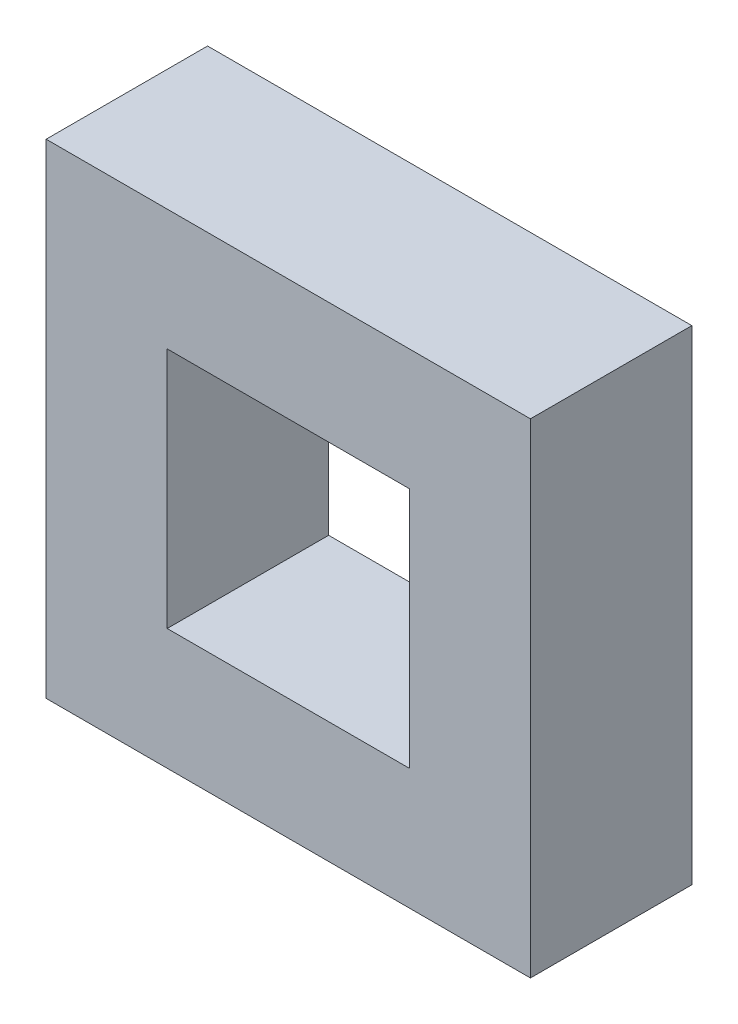
ISO-10303-21;
HEADER;
FILE_DESCRIPTION(('STEP AP214'),'2;1');
FILE_NAME('part.step','',(''),(''),'','','');
FILE_SCHEMA(('AUTOMOTIVE_DESIGN { 1 0 10303 214 1 1 1 1 }'));
ENDSEC;
DATA;
#1=APPLICATION_CONTEXT('core data for automotive mechanical design processes');
#2=APPLICATION_PROTOCOL_DEFINITION('international standard','automotive_design',2000,#1);
#3=PRODUCT_CONTEXT('',#1,'mechanical');
#4=PRODUCT('Part','Part','',(#3));
#5=PRODUCT_RELATED_PRODUCT_CATEGORY('part','',(#4));
#6=PRODUCT_DEFINITION_FORMATION('','',#4);
#7=PRODUCT_DEFINITION_CONTEXT('part definition',#1,'design');
#8=PRODUCT_DEFINITION('design','',#6,#7);
#9=PRODUCT_DEFINITION_SHAPE('','',#8);
#10=(LENGTH_UNIT() NAMED_UNIT(*) SI_UNIT(.MILLI.,.METRE.));
#11=(NAMED_UNIT(*) PLANE_ANGLE_UNIT() SI_UNIT($,.RADIAN.));
#12=(NAMED_UNIT(*) SI_UNIT($,.STERADIAN.) SOLID_ANGLE_UNIT());
#13=UNCERTAINTY_MEASURE_WITH_UNIT(LENGTH_MEASURE(1.E-05),#10,'distance_accuracy_value','');
#14=(GEOMETRIC_REPRESENTATION_CONTEXT(3) GLOBAL_UNCERTAINTY_ASSIGNED_CONTEXT((#13)) GLOBAL_UNIT_ASSIGNED_CONTEXT((#10,
#11,#12)) REPRESENTATION_CONTEXT('',''));
#15=CARTESIAN_POINT('',(0.,0.,0.));
#16=DIRECTION('',(0.,0.,1.));
#17=DIRECTION('',(1.,0.,0.));
#18=AXIS2_PLACEMENT_3D('',#15,#16,#17);
#19=CARTESIAN_POINT('',(-38.1,38.1,12.7));
#20=DIRECTION('',(1.,0.,0.));
#21=DIRECTION('',(0.,1.,0.));
#22=AXIS2_PLACEMENT_3D('',#19,#20,#21);
#23=PLANE('',#22);
#24=DIRECTION('',(0.,-1.,0.));
#25=VECTOR('',#24,1.);
#26=CARTESIAN_POINT('',(-38.1,38.1,-12.7));
#27=LINE('',#26,#25);
#28=CARTESIAN_POINT('',(-38.1,38.1,-12.7));
#29=VERTEX_POINT('',#28);
#30=CARTESIAN_POINT('',(-38.1,-38.1,-12.7));
#31=VERTEX_POINT('',#30);
#32=EDGE_CURVE('E130',#29,#31,#27,.T.);
#33=ORIENTED_EDGE('',*,*,#32,.T.);
#34=DIRECTION('',(0.,0.,-1.));
#35=VECTOR('',#34,1.);
#36=CARTESIAN_POINT('',(-38.1,-38.1,12.7));
#37=LINE('',#36,#35);
#38=CARTESIAN_POINT('',(-38.1,-38.1,12.7));
#39=VERTEX_POINT('',#38);
#40=EDGE_CURVE('E11',#39,#31,#37,.T.);
#41=ORIENTED_EDGE('',*,*,#40,.F.);
#42=DIRECTION('',(0.,-1.,0.));
#43=VECTOR('',#42,1.);
#44=CARTESIAN_POINT('',(-38.1,38.1,12.7));
#45=LINE('',#44,#43);
#46=CARTESIAN_POINT('',(-38.1,38.1,12.7));
#47=VERTEX_POINT('',#46);
#48=EDGE_CURVE('E134',#47,#39,#45,.T.);
#49=ORIENTED_EDGE('',*,*,#48,.F.);
#50=DIRECTION('',(0.,0.,-1.));
#51=VECTOR('',#50,1.);
#52=CARTESIAN_POINT('',(-38.1,38.1,12.7));
#53=LINE('',#52,#51);
#54=EDGE_CURVE('E144',#47,#29,#53,.T.);
#55=ORIENTED_EDGE('',*,*,#54,.T.);
#56=EDGE_LOOP('',(#33,#41,#49,#55));
#57=FACE_BOUND('',#56,.T.);
#58=ADVANCED_FACE('F33',(#57),#23,.F.);
#59=CARTESIAN_POINT('',(-38.1,-38.1,12.7));
#60=DIRECTION('',(0.,1.,0.));
#61=DIRECTION('',(0.,0.,1.));
#62=AXIS2_PLACEMENT_3D('',#59,#60,#61);
#63=PLANE('',#62);
#64=DIRECTION('',(1.,0.,0.));
#65=VECTOR('',#64,1.);
#66=CARTESIAN_POINT('',(-38.1,-38.1,-12.7));
#67=LINE('',#66,#65);
#68=CARTESIAN_POINT('',(38.1,-38.1,-12.7));
#69=VERTEX_POINT('',#68);
#70=EDGE_CURVE('E147',#31,#69,#67,.T.);
#71=ORIENTED_EDGE('',*,*,#70,.T.);
#72=DIRECTION('',(0.,0.,-1.));
#73=VECTOR('',#72,1.);
#74=CARTESIAN_POINT('',(38.1,-38.1,12.7));
#75=LINE('',#74,#73);
#76=CARTESIAN_POINT('',(38.1,-38.1,12.7));
#77=VERTEX_POINT('',#76);
#78=EDGE_CURVE('E40',#77,#69,#75,.T.);
#79=ORIENTED_EDGE('',*,*,#78,.F.);
#80=DIRECTION('',(1.,0.,0.));
#81=VECTOR('',#80,1.);
#82=CARTESIAN_POINT('',(-38.1,-38.1,12.7));
#83=LINE('',#82,#81);
#84=EDGE_CURVE('E137',#39,#77,#83,.T.);
#85=ORIENTED_EDGE('',*,*,#84,.F.);
#86=ORIENTED_EDGE('',*,*,#40,.T.);
#87=EDGE_LOOP('',(#71,#79,#85,#86));
#88=FACE_BOUND('',#87,.T.);
#89=ADVANCED_FACE('F175',(#88),#63,.F.);
#90=CARTESIAN_POINT('',(38.1,38.1,12.7));
#91=DIRECTION('',(-1.,0.,0.));
#92=DIRECTION('',(0.,-1.,0.));
#93=AXIS2_PLACEMENT_3D('',#90,#91,#92);
#94=PLANE('',#93);
#95=DIRECTION('',(0.,1.,0.));
#96=VECTOR('',#95,1.);
#97=CARTESIAN_POINT('',(38.1,38.1,-12.7));
#98=LINE('',#97,#96);
#99=CARTESIAN_POINT('',(38.1,38.1,-12.7));
#100=VERTEX_POINT('',#99);
#101=EDGE_CURVE('E149',#69,#100,#98,.T.);
#102=ORIENTED_EDGE('',*,*,#101,.T.);
#103=DIRECTION('',(0.,0.,-1.));
#104=VECTOR('',#103,1.);
#105=CARTESIAN_POINT('',(38.1,38.1,12.7));
#106=LINE('',#105,#104);
#107=CARTESIAN_POINT('',(38.1,38.1,12.7));
#108=VERTEX_POINT('',#107);
#109=EDGE_CURVE('E154',#108,#100,#106,.T.);
#110=ORIENTED_EDGE('',*,*,#109,.F.);
#111=DIRECTION('',(0.,1.,0.));
#112=VECTOR('',#111,1.);
#113=CARTESIAN_POINT('',(38.1,38.1,12.7));
#114=LINE('',#113,#112);
#115=EDGE_CURVE('E140',#77,#108,#114,.T.);
#116=ORIENTED_EDGE('',*,*,#115,.F.);
#117=ORIENTED_EDGE('',*,*,#78,.T.);
#118=EDGE_LOOP('',(#102,#110,#116,#117));
#119=FACE_BOUND('',#118,.T.);
#120=ADVANCED_FACE('F161',(#119),#94,.F.);
#121=CARTESIAN_POINT('',(-38.1,38.1,12.7));
#122=DIRECTION('',(0.,-1.,0.));
#123=DIRECTION('',(0.,0.,-1.));
#124=AXIS2_PLACEMENT_3D('',#121,#122,#123);
#125=PLANE('',#124);
#126=DIRECTION('',(-1.,0.,0.));
#127=VECTOR('',#126,1.);
#128=CARTESIAN_POINT('',(-38.1,38.1,-12.7));
#129=LINE('',#128,#127);
#130=EDGE_CURVE('E138',#100,#29,#129,.T.);
#131=ORIENTED_EDGE('',*,*,#130,.T.);
#132=ORIENTED_EDGE('',*,*,#54,.F.);
#133=DIRECTION('',(-1.,0.,0.));
#134=VECTOR('',#133,1.);
#135=CARTESIAN_POINT('',(-38.1,38.1,12.7));
#136=LINE('',#135,#134);
#137=EDGE_CURVE('E142',#108,#47,#136,.T.);
#138=ORIENTED_EDGE('',*,*,#137,.F.);
#139=ORIENTED_EDGE('',*,*,#109,.T.);
#140=EDGE_LOOP('',(#131,#132,#138,#139));
#141=FACE_BOUND('',#140,.T.);
#142=ADVANCED_FACE('F168',(#141),#125,.F.);
#143=CARTESIAN_POINT('',(0.,0.,12.7));
#144=DIRECTION('',(0.,0.,1.));
#145=DIRECTION('',(1.,0.,0.));
#146=AXIS2_PLACEMENT_3D('',#143,#144,#145);
#147=PLANE('',#146);
#148=DIRECTION('',(0.,-1.,0.));
#149=VECTOR('',#148,1.);
#150=CARTESIAN_POINT('',(-19.05,19.05,12.7));
#151=LINE('',#150,#149);
#152=CARTESIAN_POINT('',(-19.05,19.05,12.7));
#153=VERTEX_POINT('',#152);
#154=CARTESIAN_POINT('',(-19.05,-19.05,12.7));
#155=VERTEX_POINT('',#154);
#156=EDGE_CURVE('E47',#153,#155,#151,.T.);
#157=ORIENTED_EDGE('',*,*,#156,.F.);
#158=DIRECTION('',(-1.,0.,0.));
#159=VECTOR('',#158,1.);
#160=CARTESIAN_POINT('',(-19.05,19.05,12.7));
#161=LINE('',#160,#159);
#162=CARTESIAN_POINT('',(19.05,19.05,12.7));
#163=VERTEX_POINT('',#162);
#164=EDGE_CURVE('E115',#163,#153,#161,.T.);
#165=ORIENTED_EDGE('',*,*,#164,.F.);
#166=DIRECTION('',(0.,1.,0.));
#167=VECTOR('',#166,1.);
#168=CARTESIAN_POINT('',(19.05,19.05,12.7));
#169=LINE('',#168,#167);
#170=CARTESIAN_POINT('',(19.05,-19.05,12.7));
#171=VERTEX_POINT('',#170);
#172=EDGE_CURVE('E118',#171,#163,#169,.T.);
#173=ORIENTED_EDGE('',*,*,#172,.F.);
#174=DIRECTION('',(1.,0.,0.));
#175=VECTOR('',#174,1.);
#176=CARTESIAN_POINT('',(-19.05,-19.05,12.7));
#177=LINE('',#176,#175);
#178=EDGE_CURVE('E124',#155,#171,#177,.T.);
#179=ORIENTED_EDGE('',*,*,#178,.F.);
#180=EDGE_LOOP('',(#157,#165,#173,#179));
#181=FACE_BOUND('',#180,.T.);
#182=ORIENTED_EDGE('',*,*,#48,.T.);
#183=ORIENTED_EDGE('',*,*,#84,.T.);
#184=ORIENTED_EDGE('',*,*,#115,.T.);
#185=ORIENTED_EDGE('',*,*,#137,.T.);
#186=EDGE_LOOP('',(#182,#183,#184,#185));
#187=FACE_BOUND('',#186,.T.);
#188=ADVANCED_FACE('F174',(#181,#187),#147,.T.);
#189=CARTESIAN_POINT('',(0.,0.,-12.7));
#190=DIRECTION('',(0.,0.,1.));
#191=DIRECTION('',(1.,0.,0.));
#192=AXIS2_PLACEMENT_3D('',#189,#190,#191);
#193=PLANE('',#192);
#194=DIRECTION('',(-1.,0.,0.));
#195=VECTOR('',#194,1.);
#196=CARTESIAN_POINT('',(-19.05,19.05,-12.7));
#197=LINE('',#196,#195);
#198=CARTESIAN_POINT('',(19.05,19.05,-12.7));
#199=VERTEX_POINT('',#198);
#200=CARTESIAN_POINT('',(-19.05,19.05,-12.7));
#201=VERTEX_POINT('',#200);
#202=EDGE_CURVE('E105',#199,#201,#197,.T.);
#203=ORIENTED_EDGE('',*,*,#202,.T.);
#204=DIRECTION('',(0.,-1.,0.));
#205=VECTOR('',#204,1.);
#206=CARTESIAN_POINT('',(-19.05,19.05,-12.7));
#207=LINE('',#206,#205);
#208=CARTESIAN_POINT('',(-19.05,-19.05,-12.7));
#209=VERTEX_POINT('',#208);
#210=EDGE_CURVE('E99',#201,#209,#207,.T.);
#211=ORIENTED_EDGE('',*,*,#210,.T.);
#212=DIRECTION('',(1.,0.,0.));
#213=VECTOR('',#212,1.);
#214=CARTESIAN_POINT('',(-19.05,-19.05,-12.7));
#215=LINE('',#214,#213);
#216=CARTESIAN_POINT('',(19.05,-19.05,-12.7));
#217=VERTEX_POINT('',#216);
#218=EDGE_CURVE('E108',#209,#217,#215,.T.);
#219=ORIENTED_EDGE('',*,*,#218,.T.);
#220=DIRECTION('',(0.,1.,0.));
#221=VECTOR('',#220,1.);
#222=CARTESIAN_POINT('',(19.05,19.05,-12.7));
#223=LINE('',#222,#221);
#224=EDGE_CURVE('E55',#217,#199,#223,.T.);
#225=ORIENTED_EDGE('',*,*,#224,.T.);
#226=EDGE_LOOP('',(#203,#211,#219,#225));
#227=FACE_BOUND('',#226,.T.);
#228=ORIENTED_EDGE('',*,*,#32,.F.);
#229=ORIENTED_EDGE('',*,*,#130,.F.);
#230=ORIENTED_EDGE('',*,*,#101,.F.);
#231=ORIENTED_EDGE('',*,*,#70,.F.);
#232=EDGE_LOOP('',(#228,#229,#230,#231));
#233=FACE_BOUND('',#232,.T.);
#234=ADVANCED_FACE('F112',(#227,#233),#193,.F.);
#235=CARTESIAN_POINT('',(-19.05,19.05,-12.7));
#236=DIRECTION('',(-1.,0.,0.));
#237=DIRECTION('',(0.,-1.,0.));
#238=AXIS2_PLACEMENT_3D('',#235,#236,#237);
#239=PLANE('',#238);
#240=ORIENTED_EDGE('',*,*,#156,.T.);
#241=DIRECTION('',(0.,0.,1.));
#242=VECTOR('',#241,1.);
#243=CARTESIAN_POINT('',(-19.05,-19.05,-12.7));
#244=LINE('',#243,#242);
#245=EDGE_CURVE('E95',#209,#155,#244,.T.);
#246=ORIENTED_EDGE('',*,*,#245,.F.);
#247=ORIENTED_EDGE('',*,*,#210,.F.);
#248=DIRECTION('',(0.,0.,1.));
#249=VECTOR('',#248,1.);
#250=CARTESIAN_POINT('',(-19.05,19.05,-12.7));
#251=LINE('',#250,#249);
#252=EDGE_CURVE('E128',#201,#153,#251,.T.);
#253=ORIENTED_EDGE('',*,*,#252,.T.);
#254=EDGE_LOOP('',(#240,#246,#247,#253));
#255=FACE_BOUND('',#254,.T.);
#256=ADVANCED_FACE('F97',(#255),#239,.F.);
#257=CARTESIAN_POINT('',(-19.05,19.05,-12.7));
#258=DIRECTION('',(0.,1.,0.));
#259=DIRECTION('',(0.,0.,1.));
#260=AXIS2_PLACEMENT_3D('',#257,#258,#259);
#261=PLANE('',#260);
#262=ORIENTED_EDGE('',*,*,#164,.T.);
#263=ORIENTED_EDGE('',*,*,#252,.F.);
#264=ORIENTED_EDGE('',*,*,#202,.F.);
#265=DIRECTION('',(0.,0.,1.));
#266=VECTOR('',#265,1.);
#267=CARTESIAN_POINT('',(19.05,19.05,-12.7));
#268=LINE('',#267,#266);
#269=EDGE_CURVE('E131',#199,#163,#268,.T.);
#270=ORIENTED_EDGE('',*,*,#269,.T.);
#271=EDGE_LOOP('',(#262,#263,#264,#270));
#272=FACE_BOUND('',#271,.T.);
#273=ADVANCED_FACE('F192',(#272),#261,.F.);
#274=CARTESIAN_POINT('',(19.05,19.05,-12.7));
#275=DIRECTION('',(1.,0.,0.));
#276=DIRECTION('',(0.,1.,0.));
#277=AXIS2_PLACEMENT_3D('',#274,#275,#276);
#278=PLANE('',#277);
#279=ORIENTED_EDGE('',*,*,#172,.T.);
#280=ORIENTED_EDGE('',*,*,#269,.F.);
#281=ORIENTED_EDGE('',*,*,#224,.F.);
#282=DIRECTION('',(0.,0.,1.));
#283=VECTOR('',#282,1.);
#284=CARTESIAN_POINT('',(19.05,-19.05,-12.7));
#285=LINE('',#284,#283);
#286=EDGE_CURVE('E104',#217,#171,#285,.T.);
#287=ORIENTED_EDGE('',*,*,#286,.T.);
#288=EDGE_LOOP('',(#279,#280,#281,#287));
#289=FACE_BOUND('',#288,.T.);
#290=ADVANCED_FACE('F195',(#289),#278,.F.);
#291=CARTESIAN_POINT('',(-19.05,-19.05,-12.7));
#292=DIRECTION('',(0.,-1.,0.));
#293=DIRECTION('',(0.,0.,-1.));
#294=AXIS2_PLACEMENT_3D('',#291,#292,#293);
#295=PLANE('',#294);
#296=ORIENTED_EDGE('',*,*,#178,.T.);
#297=ORIENTED_EDGE('',*,*,#286,.F.);
#298=ORIENTED_EDGE('',*,*,#218,.F.);
#299=ORIENTED_EDGE('',*,*,#245,.T.);
#300=EDGE_LOOP('',(#296,#297,#298,#299));
#301=FACE_BOUND('',#300,.T.);
#302=ADVANCED_FACE('F109',(#301),#295,.F.);
#303=CLOSED_SHELL('',(#58,#89,#120,#142,#188,#234,#256,#273,#290,#302));
#304=MANIFOLD_SOLID_BREP('B2',#303);
#305=ADVANCED_BREP_SHAPE_REPRESENTATION('',(#18,#304),#14);
#306=SHAPE_DEFINITION_REPRESENTATION(#9,#305);
ENDSEC;
END-ISO-10303-21;
